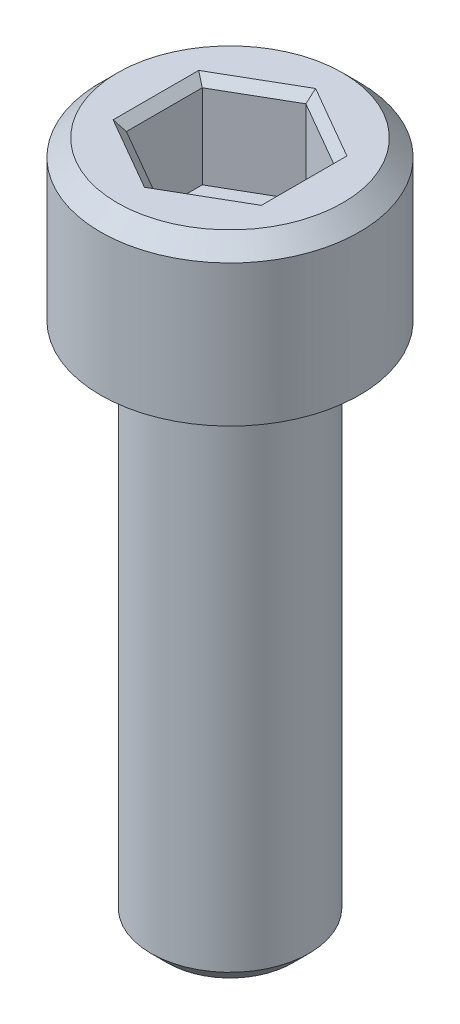
ISO-10303-21;
HEADER;
FILE_DESCRIPTION(('STEP AP214'),'2;1');
FILE_NAME('part.step','',(''),(''),'','','');
FILE_SCHEMA(('AUTOMOTIVE_DESIGN { 1 0 10303 214 1 1 1 1 }'));
ENDSEC;
DATA;
#1=APPLICATION_CONTEXT('core data for automotive mechanical design processes');
#2=APPLICATION_PROTOCOL_DEFINITION('international standard','automotive_design',2000,#1);
#3=PRODUCT_CONTEXT('',#1,'mechanical');
#4=PRODUCT('Part','Part','',(#3));
#5=PRODUCT_RELATED_PRODUCT_CATEGORY('part','',(#4));
#6=PRODUCT_DEFINITION_FORMATION('','',#4);
#7=PRODUCT_DEFINITION_CONTEXT('part definition',#1,'design');
#8=PRODUCT_DEFINITION('design','',#6,#7);
#9=PRODUCT_DEFINITION_SHAPE('','',#8);
#10=(LENGTH_UNIT() NAMED_UNIT(*) SI_UNIT(.MILLI.,.METRE.));
#11=(NAMED_UNIT(*) PLANE_ANGLE_UNIT() SI_UNIT($,.RADIAN.));
#12=(NAMED_UNIT(*) SI_UNIT($,.STERADIAN.) SOLID_ANGLE_UNIT());
#13=UNCERTAINTY_MEASURE_WITH_UNIT(LENGTH_MEASURE(1.E-05),#10,'distance_accuracy_value','');
#14=(GEOMETRIC_REPRESENTATION_CONTEXT(3) GLOBAL_UNCERTAINTY_ASSIGNED_CONTEXT((#13)) GLOBAL_UNIT_ASSIGNED_CONTEXT((#10,
#11,#12)) REPRESENTATION_CONTEXT('',''));
#15=CARTESIAN_POINT('',(0.,0.,0.));
#16=DIRECTION('',(0.,0.,1.));
#17=DIRECTION('',(1.,0.,0.));
#18=AXIS2_PLACEMENT_3D('',#15,#16,#17);
#19=CARTESIAN_POINT('',(-3.96874999999999,-2.79399999999996,0.));
#20=DIRECTION('',(0.,-1.,0.));
#21=DIRECTION('',(0.,0.,-1.));
#22=AXIS2_PLACEMENT_3D('',#19,#20,#21);
#23=PLANE('',#22);
#24=DIRECTION('',(-0.866025403784439,0.,0.5));
#25=VECTOR('',#24,1.);
#26=CARTESIAN_POINT('',(1.98437500000001,-2.79399999999996,1.14567944042317));
#27=LINE('',#26,#25);
#28=CARTESIAN_POINT('',(1.98437500000001,-2.79399999999996,1.14567944042317));
#29=VERTEX_POINT('',#28);
#30=CARTESIAN_POINT('',(0.,-2.79399999999996,2.29135888084634));
#31=VERTEX_POINT('',#30);
#32=EDGE_CURVE('E85',#29,#31,#27,.T.);
#33=ORIENTED_EDGE('',*,*,#32,.F.);
#34=DIRECTION('',(0.,0.,1.));
#35=VECTOR('',#34,1.);
#36=CARTESIAN_POINT('',(1.98437500000001,-2.79399999999996,-1.14567944042316));
#37=LINE('',#36,#35);
#38=CARTESIAN_POINT('',(1.98437500000001,-2.79399999999996,-1.14567944042316));
#39=VERTEX_POINT('',#38);
#40=EDGE_CURVE('E90',#39,#29,#37,.T.);
#41=ORIENTED_EDGE('',*,*,#40,.F.);
#42=DIRECTION('',(0.866025403784439,0.,0.5));
#43=VECTOR('',#42,1.);
#44=CARTESIAN_POINT('',(0.,-2.79399999999996,-2.29135888084632));
#45=LINE('',#44,#43);
#46=CARTESIAN_POINT('',(0.,-2.79399999999996,-2.29135888084632));
#47=VERTEX_POINT('',#46);
#48=EDGE_CURVE('E171',#47,#39,#45,.T.);
#49=ORIENTED_EDGE('',*,*,#48,.F.);
#50=DIRECTION('',(0.866025403784438,0.,-0.500000000000001));
#51=VECTOR('',#50,1.);
#52=CARTESIAN_POINT('',(-1.984375,-2.79399999999996,-1.14567944042316));
#53=LINE('',#52,#51);
#54=CARTESIAN_POINT('',(-1.984375,-2.79399999999996,-1.14567944042316));
#55=VERTEX_POINT('',#54);
#56=EDGE_CURVE('E177',#55,#47,#53,.T.);
#57=ORIENTED_EDGE('',*,*,#56,.F.);
#58=DIRECTION('',(0.,0.,-1.));
#59=VECTOR('',#58,1.);
#60=CARTESIAN_POINT('',(-1.984375,-2.79399999999996,1.14567944042317));
#61=LINE('',#60,#59);
#62=CARTESIAN_POINT('',(-1.984375,-2.79399999999996,1.14567944042317));
#63=VERTEX_POINT('',#62);
#64=EDGE_CURVE('E182',#63,#55,#61,.T.);
#65=ORIENTED_EDGE('',*,*,#64,.F.);
#66=DIRECTION('',(-0.866025403784438,0.,-0.5));
#67=VECTOR('',#66,1.);
#68=CARTESIAN_POINT('',(0.,-2.79399999999996,2.29135888084634));
#69=LINE('',#68,#67);
#70=EDGE_CURVE('E101',#31,#63,#69,.T.);
#71=ORIENTED_EDGE('',*,*,#70,.F.);
#72=EDGE_LOOP('',(#33,#41,#49,#57,#65,#71));
#73=FACE_BOUND('',#72,.T.);
#74=ADVANCED_FACE('F16',(#73),#23,.F.);
#75=CARTESIAN_POINT('',(1.98437500000001,-2.79399999999996,-1.14567944042316));
#76=DIRECTION('',(-1.,0.,0.));
#77=DIRECTION('',(0.,0.,1.));
#78=AXIS2_PLACEMENT_3D('',#75,#76,#77);
#79=PLANE('',#78);
#80=DIRECTION('',(0.,1.,0.));
#81=VECTOR('',#80,1.);
#82=CARTESIAN_POINT('',(1.98437500000001,-2.79399999999996,-1.14567944042315));
#83=LINE('',#82,#81);
#84=CARTESIAN_POINT('',(1.98437500000001,-0.25399999999998,-1.14567944042316));
#85=VERTEX_POINT('',#84);
#86=EDGE_CURVE('E95',#39,#85,#83,.T.);
#87=ORIENTED_EDGE('',*,*,#86,.F.);
#88=ORIENTED_EDGE('',*,*,#40,.T.);
#89=DIRECTION('',(0.,1.,0.));
#90=VECTOR('',#89,1.);
#91=CARTESIAN_POINT('',(1.98437500000001,-2.79399999999996,1.14567944042317));
#92=LINE('',#91,#90);
#93=CARTESIAN_POINT('',(1.98437500000001,-0.253999999999979,1.14567944042318));
#94=VERTEX_POINT('',#93);
#95=EDGE_CURVE('E92',#94,#29,#92,.F.);
#96=ORIENTED_EDGE('',*,*,#95,.F.);
#97=DIRECTION('',(0.,0.,1.));
#98=VECTOR('',#97,1.);
#99=CARTESIAN_POINT('',(1.98437500000002,-0.253999999999987,0.));
#100=LINE('',#99,#98);
#101=EDGE_CURVE('E169',#94,#85,#100,.F.);
#102=ORIENTED_EDGE('',*,*,#101,.T.);
#103=EDGE_LOOP('',(#87,#88,#96,#102));
#104=FACE_BOUND('',#103,.T.);
#105=ADVANCED_FACE('F91',(#104),#79,.T.);
#106=CARTESIAN_POINT('',(1.98437500000001,-2.79399999999996,1.14567944042317));
#107=DIRECTION('',(-0.5,0.,-0.866025403784439));
#108=DIRECTION('',(-0.866025403784439,0.,0.5));
#109=AXIS2_PLACEMENT_3D('',#106,#107,#108);
#110=PLANE('',#109);
#111=ORIENTED_EDGE('',*,*,#95,.T.);
#112=ORIENTED_EDGE('',*,*,#32,.T.);
#113=DIRECTION('',(0.,1.,0.));
#114=VECTOR('',#113,1.);
#115=CARTESIAN_POINT('',(0.,-2.79399999999996,2.29135888084634));
#116=LINE('',#115,#114);
#117=CARTESIAN_POINT('',(0.,-0.253999999999979,2.29135888084634));
#118=VERTEX_POINT('',#117);
#119=EDGE_CURVE('E103',#118,#31,#116,.F.);
#120=ORIENTED_EDGE('',*,*,#119,.F.);
#121=DIRECTION('',(0.866025403784439,0.,-0.5));
#122=VECTOR('',#121,1.);
#123=CARTESIAN_POINT('',(0.,-0.253999999999987,2.29135888084635));
#124=LINE('',#123,#122);
#125=EDGE_CURVE('E107',#118,#94,#124,.T.);
#126=ORIENTED_EDGE('',*,*,#125,.T.);
#127=EDGE_LOOP('',(#111,#112,#120,#126));
#128=FACE_BOUND('',#127,.T.);
#129=ADVANCED_FACE('F105',(#128),#110,.T.);
#130=CARTESIAN_POINT('',(0.,-2.79399999999996,2.29135888084634));
#131=DIRECTION('',(0.5,0.,-0.866025403784438));
#132=DIRECTION('',(-0.866025403784438,0.,-0.5));
#133=AXIS2_PLACEMENT_3D('',#130,#131,#132);
#134=PLANE('',#133);
#135=ORIENTED_EDGE('',*,*,#119,.T.);
#136=ORIENTED_EDGE('',*,*,#70,.T.);
#137=DIRECTION('',(0.,1.,0.));
#138=VECTOR('',#137,1.);
#139=CARTESIAN_POINT('',(-1.984375,-2.79399999999996,1.14567944042317));
#140=LINE('',#139,#138);
#141=CARTESIAN_POINT('',(-1.984375,-0.253999999999979,1.14567944042317));
#142=VERTEX_POINT('',#141);
#143=EDGE_CURVE('E184',#142,#63,#140,.F.);
#144=ORIENTED_EDGE('',*,*,#143,.F.);
#145=DIRECTION('',(0.866025403784438,0.,0.5));
#146=VECTOR('',#145,1.);
#147=CARTESIAN_POINT('',(-1.984375,-0.253999999999986,1.14567944042318));
#148=LINE('',#147,#146);
#149=EDGE_CURVE('E163',#142,#118,#148,.T.);
#150=ORIENTED_EDGE('',*,*,#149,.T.);
#151=EDGE_LOOP('',(#135,#136,#144,#150));
#152=FACE_BOUND('',#151,.T.);
#153=ADVANCED_FACE('F188',(#152),#134,.T.);
#154=CARTESIAN_POINT('',(-1.984375,-2.79399999999996,1.14567944042317));
#155=DIRECTION('',(1.,0.,0.));
#156=DIRECTION('',(0.,0.,-1.));
#157=AXIS2_PLACEMENT_3D('',#154,#155,#156);
#158=PLANE('',#157);
#159=ORIENTED_EDGE('',*,*,#143,.T.);
#160=ORIENTED_EDGE('',*,*,#64,.T.);
#161=DIRECTION('',(0.,1.,0.));
#162=VECTOR('',#161,1.);
#163=CARTESIAN_POINT('',(-1.984375,-2.79399999999996,-1.14567944042316));
#164=LINE('',#163,#162);
#165=CARTESIAN_POINT('',(-1.984375,-0.253999999999979,-1.14567944042316));
#166=VERTEX_POINT('',#165);
#167=EDGE_CURVE('E179',#166,#55,#164,.F.);
#168=ORIENTED_EDGE('',*,*,#167,.F.);
#169=DIRECTION('',(0.,0.,1.));
#170=VECTOR('',#169,1.);
#171=CARTESIAN_POINT('',(-1.98437500000001,-0.253999999999987,0.));
#172=LINE('',#171,#170);
#173=EDGE_CURVE('E158',#166,#142,#172,.T.);
#174=ORIENTED_EDGE('',*,*,#173,.T.);
#175=EDGE_LOOP('',(#159,#160,#168,#174));
#176=FACE_BOUND('',#175,.T.);
#177=ADVANCED_FACE('F218',(#176),#158,.T.);
#178=CARTESIAN_POINT('',(-1.984375,-2.79399999999996,-1.14567944042316));
#179=DIRECTION('',(0.500000000000001,0.,0.866025403784438));
#180=DIRECTION('',(0.866025403784438,0.,-0.500000000000001));
#181=AXIS2_PLACEMENT_3D('',#178,#179,#180);
#182=PLANE('',#181);
#183=ORIENTED_EDGE('',*,*,#167,.T.);
#184=ORIENTED_EDGE('',*,*,#56,.T.);
#185=DIRECTION('',(0.,1.,0.));
#186=VECTOR('',#185,1.);
#187=CARTESIAN_POINT('',(0.,-2.79399999999996,-2.29135888084632));
#188=LINE('',#187,#186);
#189=CARTESIAN_POINT('',(0.,-0.253999999999979,-2.29135888084633));
#190=VERTEX_POINT('',#189);
#191=EDGE_CURVE('E173',#190,#47,#188,.F.);
#192=ORIENTED_EDGE('',*,*,#191,.F.);
#193=DIRECTION('',(-0.866025403784439,0.,0.499999999999999));
#194=VECTOR('',#193,1.);
#195=CARTESIAN_POINT('',(0.,-0.25399999999999,-2.29135888084633));
#196=LINE('',#195,#194);
#197=EDGE_CURVE('E153',#190,#166,#196,.T.);
#198=ORIENTED_EDGE('',*,*,#197,.T.);
#199=EDGE_LOOP('',(#183,#184,#192,#198));
#200=FACE_BOUND('',#199,.T.);
#201=ADVANCED_FACE('F214',(#200),#182,.T.);
#202=CARTESIAN_POINT('',(0.,-2.79399999999996,-2.29135888084632));
#203=DIRECTION('',(-0.5,0.,0.866025403784439));
#204=DIRECTION('',(0.866025403784439,0.,0.5));
#205=AXIS2_PLACEMENT_3D('',#202,#203,#204);
#206=PLANE('',#205);
#207=ORIENTED_EDGE('',*,*,#191,.T.);
#208=ORIENTED_EDGE('',*,*,#48,.T.);
#209=ORIENTED_EDGE('',*,*,#86,.T.);
#210=DIRECTION('',(-0.866025403784439,0.,-0.499999999999999));
#211=VECTOR('',#210,1.);
#212=CARTESIAN_POINT('',(1.98437500000001,-0.253999999999985,-1.14567944042317));
#213=LINE('',#212,#211);
#214=EDGE_CURVE('E145',#85,#190,#213,.T.);
#215=ORIENTED_EDGE('',*,*,#214,.T.);
#216=EDGE_LOOP('',(#207,#208,#209,#215));
#217=FACE_BOUND('',#216,.T.);
#218=ADVANCED_FACE('F209',(#217),#206,.T.);
#219=CARTESIAN_POINT('',(2.23837500000001,0.,0.));
#220=DIRECTION('',(0.707106781186548,-0.707106781186548,0.));
#221=DIRECTION('',(0.707106781186548,0.707106781186548,0.));
#222=AXIS2_PLACEMENT_3D('',#219,#220,#221);
#223=PLANE('',#222);
#224=ORIENTED_EDGE('',*,*,#101,.F.);
#225=DIRECTION('',(0.654653670707993,0.654653670707971,0.377964473009212));
#226=VECTOR('',#225,1.);
#227=CARTESIAN_POINT('',(1.98437500000002,-0.253999999999987,1.14567944042318));
#228=LINE('',#227,#226);
#229=CARTESIAN_POINT('',(2.23837500000001,0.,1.29232640879733));
#230=VERTEX_POINT('',#229);
#231=EDGE_CURVE('E166',#94,#230,#228,.T.);
#232=ORIENTED_EDGE('',*,*,#231,.T.);
#233=DIRECTION('',(0.,0.,1.));
#234=VECTOR('',#233,1.);
#235=CARTESIAN_POINT('',(2.23837500000001,0.,0.));
#236=LINE('',#235,#234);
#237=CARTESIAN_POINT('',(2.23837500000001,0.,-1.29232640879732));
#238=VERTEX_POINT('',#237);
#239=EDGE_CURVE('E141',#238,#230,#236,.T.);
#240=ORIENTED_EDGE('',*,*,#239,.F.);
#241=DIRECTION('',(-0.654653670707993,-0.65465367070797,0.377964473009211));
#242=VECTOR('',#241,1.);
#243=CARTESIAN_POINT('',(2.23837500000001,0.,-1.29232640879732));
#244=LINE('',#243,#242);
#245=EDGE_CURVE('E148',#238,#85,#244,.T.);
#246=ORIENTED_EDGE('',*,*,#245,.T.);
#247=EDGE_LOOP('',(#224,#232,#240,#246));
#248=FACE_BOUND('',#247,.T.);
#249=ADVANCED_FACE('F204',(#248),#223,.F.);
#250=CARTESIAN_POINT('',(1.11918750000001,0.,1.938489613196));
#251=DIRECTION('',(0.353553390593273,-0.707106781186548,0.612372435695794));
#252=DIRECTION('',(0.,-0.654653670707977,-0.755928946018455));
#253=AXIS2_PLACEMENT_3D('',#250,#251,#252);
#254=PLANE('',#253);
#255=ORIENTED_EDGE('',*,*,#125,.F.);
#256=DIRECTION('',(0.,-0.654653670707977,-0.755928946018455));
#257=VECTOR('',#256,1.);
#258=CARTESIAN_POINT('',(0.,-0.319767857142858,2.21541670079542));
#259=LINE('',#258,#257);
#260=CARTESIAN_POINT('',(0.,0.,2.58465281759466));
#261=VERTEX_POINT('',#260);
#262=EDGE_CURVE('E161',#118,#261,#259,.F.);
#263=ORIENTED_EDGE('',*,*,#262,.T.);
#264=DIRECTION('',(-0.866025403784438,0.,0.500000000000001));
#265=VECTOR('',#264,1.);
#266=CARTESIAN_POINT('',(2.23837500000001,0.,1.29232640879733));
#267=LINE('',#266,#265);
#268=EDGE_CURVE('E138',#230,#261,#267,.T.);
#269=ORIENTED_EDGE('',*,*,#268,.F.);
#270=ORIENTED_EDGE('',*,*,#231,.F.);
#271=EDGE_LOOP('',(#255,#263,#269,#270));
#272=FACE_BOUND('',#271,.T.);
#273=ADVANCED_FACE('F195',(#272),#254,.F.);
#274=CARTESIAN_POINT('',(-1.1191875,0.,1.938489613196));
#275=DIRECTION('',(-0.353553390593274,-0.707106781186548,0.612372435695794));
#276=DIRECTION('',(0.,-0.654653670707977,-0.755928946018455));
#277=AXIS2_PLACEMENT_3D('',#274,#275,#276);
#278=PLANE('',#277);
#279=DIRECTION('',(-0.866025403784438,0.,-0.500000000000001));
#280=VECTOR('',#279,1.);
#281=CARTESIAN_POINT('',(0.,0.,2.58465281759467));
#282=LINE('',#281,#280);
#283=CARTESIAN_POINT('',(-2.23837499999999,0.,1.29232640879733));
#284=VERTEX_POINT('',#283);
#285=EDGE_CURVE('E135',#261,#284,#282,.T.);
#286=ORIENTED_EDGE('',*,*,#285,.F.);
#287=ORIENTED_EDGE('',*,*,#262,.F.);
#288=ORIENTED_EDGE('',*,*,#149,.F.);
#289=DIRECTION('',(-0.654653670707976,0.654653670707976,0.377964473009231));
#290=VECTOR('',#289,1.);
#291=CARTESIAN_POINT('',(-1.98437500000001,-0.253999999999987,1.14567944042317));
#292=LINE('',#291,#290);
#293=EDGE_CURVE('E156',#142,#284,#292,.T.);
#294=ORIENTED_EDGE('',*,*,#293,.T.);
#295=EDGE_LOOP('',(#286,#287,#288,#294));
#296=FACE_BOUND('',#295,.T.);
#297=ADVANCED_FACE('F198',(#296),#278,.F.);
#298=CARTESIAN_POINT('',(-2.23837499999999,0.,0.));
#299=DIRECTION('',(-0.707106781186548,-0.707106781186548,0.));
#300=DIRECTION('',(0.707106781186548,-0.707106781186548,0.));
#301=AXIS2_PLACEMENT_3D('',#298,#299,#300);
#302=PLANE('',#301);
#303=DIRECTION('',(0.,0.,1.));
#304=VECTOR('',#303,1.);
#305=CARTESIAN_POINT('',(-2.23837499999999,0.,0.));
#306=LINE('',#305,#304);
#307=CARTESIAN_POINT('',(-2.23837499999999,0.,-1.29232640879732));
#308=VERTEX_POINT('',#307);
#309=EDGE_CURVE('E132',#284,#308,#306,.F.);
#310=ORIENTED_EDGE('',*,*,#309,.F.);
#311=ORIENTED_EDGE('',*,*,#293,.F.);
#312=ORIENTED_EDGE('',*,*,#173,.F.);
#313=DIRECTION('',(-0.654653670707992,0.654653670707971,-0.377964473009212));
#314=VECTOR('',#313,1.);
#315=CARTESIAN_POINT('',(-1.984375,-0.253999999999987,-1.14567944042317));
#316=LINE('',#315,#314);
#317=EDGE_CURVE('E151',#166,#308,#316,.T.);
#318=ORIENTED_EDGE('',*,*,#317,.T.);
#319=EDGE_LOOP('',(#310,#311,#312,#318));
#320=FACE_BOUND('',#319,.T.);
#321=ADVANCED_FACE('F216',(#320),#302,.F.);
#322=CARTESIAN_POINT('',(-1.11918749999999,0.,-1.93848961319599));
#323=DIRECTION('',(-0.353553390593274,-0.707106781186548,-0.612372435695794));
#324=DIRECTION('',(0.,0.654653670707977,-0.755928946018455));
#325=AXIS2_PLACEMENT_3D('',#322,#323,#324);
#326=PLANE('',#325);
#327=ORIENTED_EDGE('',*,*,#197,.F.);
#328=DIRECTION('',(0.,0.654653670707977,-0.755928946018455));
#329=VECTOR('',#328,1.);
#330=CARTESIAN_POINT('',(0.,-0.319767857142854,-2.21541670079541));
#331=LINE('',#330,#329);
#332=CARTESIAN_POINT('',(0.,0.,-2.58465281759465));
#333=VERTEX_POINT('',#332);
#334=EDGE_CURVE('E34',#190,#333,#331,.T.);
#335=ORIENTED_EDGE('',*,*,#334,.T.);
#336=DIRECTION('',(0.866025403784438,0.,-0.500000000000001));
#337=VECTOR('',#336,1.);
#338=CARTESIAN_POINT('',(-2.23837499999999,0.,-1.29232640879732));
#339=LINE('',#338,#337);
#340=EDGE_CURVE('E129',#308,#333,#339,.T.);
#341=ORIENTED_EDGE('',*,*,#340,.F.);
#342=ORIENTED_EDGE('',*,*,#317,.F.);
#343=EDGE_LOOP('',(#327,#335,#341,#342));
#344=FACE_BOUND('',#343,.T.);
#345=ADVANCED_FACE('F211',(#344),#326,.F.);
#346=CARTESIAN_POINT('',(1.1191875,0.,-1.93848961319599));
#347=DIRECTION('',(0.353553390593274,-0.707106781186548,-0.612372435695794));
#348=DIRECTION('',(0.,0.654653670707977,-0.755928946018455));
#349=AXIS2_PLACEMENT_3D('',#346,#347,#348);
#350=PLANE('',#349);
#351=ORIENTED_EDGE('',*,*,#214,.F.);
#352=ORIENTED_EDGE('',*,*,#245,.F.);
#353=DIRECTION('',(0.866025403784438,0.,0.500000000000001));
#354=VECTOR('',#353,1.);
#355=CARTESIAN_POINT('',(0.,0.,-2.58465281759465));
#356=LINE('',#355,#354);
#357=EDGE_CURVE('E124',#333,#238,#356,.T.);
#358=ORIENTED_EDGE('',*,*,#357,.F.);
#359=ORIENTED_EDGE('',*,*,#334,.F.);
#360=EDGE_LOOP('',(#351,#352,#358,#359));
#361=FACE_BOUND('',#360,.T.);
#362=ADVANCED_FACE('F207',(#361),#350,.F.);
#363=CARTESIAN_POINT('',(0.,0.,0.));
#364=DIRECTION('',(0.,1.,0.));
#365=DIRECTION('',(0.,0.,1.));
#366=AXIS2_PLACEMENT_3D('',#363,#364,#365);
#367=PLANE('',#366);
#368=CARTESIAN_POINT('',(0.,-5.6843418860808E-11,0.));
#369=DIRECTION('',(0.,-1.,0.));
#370=DIRECTION('',(0.,0.,-1.));
#371=AXIS2_PLACEMENT_3D('',#368,#369,#370);
#372=CIRCLE('',#371,3.40360000001283);
#373=CARTESIAN_POINT('',(0.,-5.6843418860808E-11,-3.40360000001283));
#374=VERTEX_POINT('',#373);
#375=EDGE_CURVE('E19',#374,#374,#372,.T.);
#376=ORIENTED_EDGE('',*,*,#375,.F.);
#377=EDGE_LOOP('',(#376));
#378=FACE_BOUND('',#377,.T.);
#379=ORIENTED_EDGE('',*,*,#340,.T.);
#380=ORIENTED_EDGE('',*,*,#357,.T.);
#381=ORIENTED_EDGE('',*,*,#239,.T.);
#382=ORIENTED_EDGE('',*,*,#268,.T.);
#383=ORIENTED_EDGE('',*,*,#285,.T.);
#384=ORIENTED_EDGE('',*,*,#309,.T.);
#385=EDGE_LOOP('',(#379,#380,#381,#382,#383,#384));
#386=FACE_BOUND('',#385,.T.);
#387=ADVANCED_FACE('F201',(#378,#386),#367,.T.);
#388=CARTESIAN_POINT('',(0.,-0.507999999911135,0.));
#389=DIRECTION('',(0.,-1.,0.));
#390=DIRECTION('',(0.,0.,-1.));
#391=AXIS2_PLACEMENT_3D('',#388,#389,#390);
#392=CONICAL_SURFACE('',#391,3.91159999986712,0.785398163397448);
#393=CARTESIAN_POINT('',(0.,-0.507999999999953,0.));
#394=DIRECTION('',(0.,1.,0.));
#395=DIRECTION('',(0.,0.,1.));
#396=AXIS2_PLACEMENT_3D('',#393,#394,#395);
#397=CIRCLE('',#396,3.9116);
#398=CARTESIAN_POINT('',(0.,-0.507999999999953,3.9116));
#399=VERTEX_POINT('',#398);
#400=EDGE_CURVE('E116',#399,#399,#397,.F.);
#401=ORIENTED_EDGE('',*,*,#400,.F.);
#402=EDGE_LOOP('',(#401));
#403=FACE_BOUND('',#402,.T.);
#404=ORIENTED_EDGE('',*,*,#375,.T.);
#405=EDGE_LOOP('',(#404));
#406=FACE_BOUND('',#405,.T.);
#407=ADVANCED_FACE('F251',(#403,#406),#392,.T.);
#408=CARTESIAN_POINT('',(0.,-20.6502,0.));
#409=DIRECTION('',(0.,1.,0.));
#410=DIRECTION('',(0.,0.,1.));
#411=AXIS2_PLACEMENT_3D('',#408,#409,#410);
#412=PLANE('',#411);
#413=CARTESIAN_POINT('',(0.,-20.6502000000341,0.));
#414=DIRECTION('',(0.,1.,0.));
#415=DIRECTION('',(0.,0.,1.));
#416=AXIS2_PLACEMENT_3D('',#413,#414,#415);
#417=CIRCLE('',#416,1.87959999993836);
#418=CARTESIAN_POINT('',(0.,-20.6502000000341,1.87959999993836));
#419=VERTEX_POINT('',#418);
#420=EDGE_CURVE('E114',#419,#419,#417,.T.);
#421=ORIENTED_EDGE('',*,*,#420,.F.);
#422=EDGE_LOOP('',(#421));
#423=FACE_BOUND('',#422,.T.);
#424=ADVANCED_FACE('F248',(#423),#412,.F.);
#425=CARTESIAN_POINT('',(0.,-4.77520000000009,0.));
#426=DIRECTION('',(0.,1.,0.));
#427=DIRECTION('',(0.,0.,1.));
#428=AXIS2_PLACEMENT_3D('',#425,#426,#427);
#429=CYLINDRICAL_SURFACE('',#428,3.9116);
#430=ORIENTED_EDGE('',*,*,#400,.T.);
#431=EDGE_LOOP('',(#430));
#432=FACE_BOUND('',#431,.T.);
#433=CARTESIAN_POINT('',(0.,-4.77520000000009,0.));
#434=DIRECTION('',(0.,1.,0.));
#435=DIRECTION('',(0.,0.,1.));
#436=AXIS2_PLACEMENT_3D('',#433,#434,#435);
#437=CIRCLE('',#436,3.9116);
#438=CARTESIAN_POINT('',(0.,-4.77520000000009,3.9116));
#439=VERTEX_POINT('',#438);
#440=EDGE_CURVE('E112',#439,#439,#437,.T.);
#441=ORIENTED_EDGE('',*,*,#440,.T.);
#442=EDGE_LOOP('',(#441));
#443=FACE_BOUND('',#442,.T.);
#444=ADVANCED_FACE('F244',(#432,#443),#429,.T.);
#445=CARTESIAN_POINT('',(0.,-20.1421999998956,0.));
#446=DIRECTION('',(0.,1.,0.));
#447=DIRECTION('',(0.,0.,1.));
#448=AXIS2_PLACEMENT_3D('',#445,#446,#447);
#449=CONICAL_SURFACE('',#448,2.38760000007687,0.785398163397448);
#450=CARTESIAN_POINT('',(0.,-20.1422,0.));
#451=DIRECTION('',(0.,1.,0.));
#452=DIRECTION('',(0.,0.,1.));
#453=AXIS2_PLACEMENT_3D('',#450,#451,#452);
#454=CIRCLE('',#453,2.3876);
#455=CARTESIAN_POINT('',(0.,-20.1422,2.3876));
#456=VERTEX_POINT('',#455);
#457=EDGE_CURVE('E25',#456,#456,#454,.T.);
#458=ORIENTED_EDGE('',*,*,#457,.F.);
#459=EDGE_LOOP('',(#458));
#460=FACE_BOUND('',#459,.T.);
#461=ORIENTED_EDGE('',*,*,#420,.T.);
#462=EDGE_LOOP('',(#461));
#463=FACE_BOUND('',#462,.T.);
#464=ADVANCED_FACE('F237',(#460,#463),#449,.T.);
#465=CARTESIAN_POINT('',(0.,-4.77520000000009,0.));
#466=DIRECTION('',(0.,1.,0.));
#467=DIRECTION('',(0.,0.,1.));
#468=AXIS2_PLACEMENT_3D('',#465,#466,#467);
#469=PLANE('',#468);
#470=ORIENTED_EDGE('',*,*,#440,.F.);
#471=EDGE_LOOP('',(#470));
#472=FACE_BOUND('',#471,.T.);
#473=CARTESIAN_POINT('',(0.,-4.77520000000009,0.));
#474=DIRECTION('',(0.,1.,0.));
#475=DIRECTION('',(0.,0.,1.));
#476=AXIS2_PLACEMENT_3D('',#473,#474,#475);
#477=CIRCLE('',#476,2.3876);
#478=CARTESIAN_POINT('',(0.,-4.77520000000009,2.3876));
#479=VERTEX_POINT('',#478);
#480=EDGE_CURVE('E11',#479,#479,#477,.F.);
#481=ORIENTED_EDGE('',*,*,#480,.F.);
#482=EDGE_LOOP('',(#481));
#483=FACE_BOUND('',#482,.T.);
#484=ADVANCED_FACE('F231',(#472,#483),#469,.F.);
#485=CARTESIAN_POINT('',(0.,-20.6502,0.));
#486=DIRECTION('',(0.,1.,0.));
#487=DIRECTION('',(0.,0.,1.));
#488=AXIS2_PLACEMENT_3D('',#485,#486,#487);
#489=CYLINDRICAL_SURFACE('',#488,2.3876);
#490=ORIENTED_EDGE('',*,*,#480,.T.);
#491=EDGE_LOOP('',(#490));
#492=FACE_BOUND('',#491,.T.);
#493=ORIENTED_EDGE('',*,*,#457,.T.);
#494=EDGE_LOOP('',(#493));
#495=FACE_BOUND('',#494,.T.);
#496=ADVANCED_FACE('F229',(#492,#495),#489,.T.);
#497=CLOSED_SHELL('',(#74,#105,#129,#153,#177,#201,#218,#249,#273,#297,#321,#345,#362,#387,#407,
#424,#444,#464,#484,#496));
#498=MANIFOLD_SOLID_BREP('B1',#497);
#499=ADVANCED_BREP_SHAPE_REPRESENTATION('',(#18,#498),#14);
#500=SHAPE_DEFINITION_REPRESENTATION(#9,#499);
ENDSEC;
END-ISO-10303-21;
